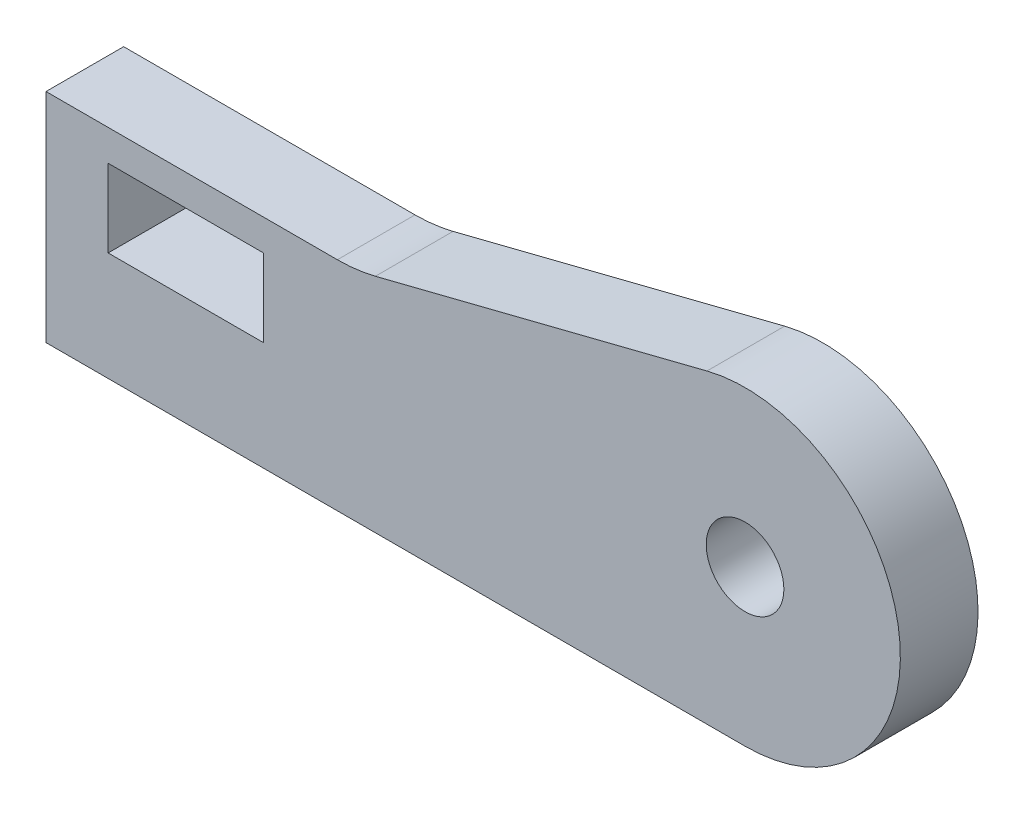
ISO-10303-21;
HEADER;
FILE_DESCRIPTION(('STEP AP214'),'2;1');
FILE_NAME('part.step','',(''),(''),'','','');
FILE_SCHEMA(('AUTOMOTIVE_DESIGN { 1 0 10303 214 1 1 1 1 }'));
ENDSEC;
DATA;
#1=APPLICATION_CONTEXT('core data for automotive mechanical design processes');
#2=APPLICATION_PROTOCOL_DEFINITION('international standard','automotive_design',2000,#1);
#3=PRODUCT_CONTEXT('',#1,'mechanical');
#4=PRODUCT('Part','Part','',(#3));
#5=PRODUCT_RELATED_PRODUCT_CATEGORY('part','',(#4));
#6=PRODUCT_DEFINITION_FORMATION('','',#4);
#7=PRODUCT_DEFINITION_CONTEXT('part definition',#1,'design');
#8=PRODUCT_DEFINITION('design','',#6,#7);
#9=PRODUCT_DEFINITION_SHAPE('','',#8);
#10=(LENGTH_UNIT() NAMED_UNIT(*) SI_UNIT(.MILLI.,.METRE.));
#11=(NAMED_UNIT(*) PLANE_ANGLE_UNIT() SI_UNIT($,.RADIAN.));
#12=(NAMED_UNIT(*) SI_UNIT($,.STERADIAN.) SOLID_ANGLE_UNIT());
#13=UNCERTAINTY_MEASURE_WITH_UNIT(LENGTH_MEASURE(1.E-05),#10,'distance_accuracy_value','');
#14=(GEOMETRIC_REPRESENTATION_CONTEXT(3) GLOBAL_UNCERTAINTY_ASSIGNED_CONTEXT((#13)) GLOBAL_UNIT_ASSIGNED_CONTEXT((#10,
#11,#12)) REPRESENTATION_CONTEXT('',''));
#15=CARTESIAN_POINT('',(0.,0.,0.));
#16=DIRECTION('',(0.,0.,1.));
#17=DIRECTION('',(1.,0.,0.));
#18=AXIS2_PLACEMENT_3D('',#15,#16,#17);
#19=CARTESIAN_POINT('',(-5.55671376494519,24.,5.));
#20=DIRECTION('',(0.,0.,1.));
#21=DIRECTION('',(1.,0.,0.));
#22=AXIS2_PLACEMENT_3D('',#19,#20,#21);
#23=PLANE('',#22);
#24=DIRECTION('',(1.,0.,0.));
#25=VECTOR('',#24,1.);
#26=CARTESIAN_POINT('',(-20.3134328358209,7.,5.));
#27=LINE('',#26,#25);
#28=CARTESIAN_POINT('',(-20.3134328358209,7.,5.));
#29=VERTEX_POINT('',#28);
#30=CARTESIAN_POINT('',(-10.3134328358209,7.,5.));
#31=VERTEX_POINT('',#30);
#32=EDGE_CURVE('E119',#29,#31,#27,.T.);
#33=ORIENTED_EDGE('',*,*,#32,.F.);
#34=DIRECTION('',(0.,-1.,0.));
#35=VECTOR('',#34,1.);
#36=CARTESIAN_POINT('',(-20.3134328358209,12.,5.));
#37=LINE('',#36,#35);
#38=CARTESIAN_POINT('',(-20.3134328358209,12.,5.));
#39=VERTEX_POINT('',#38);
#40=EDGE_CURVE('E111',#39,#29,#37,.T.);
#41=ORIENTED_EDGE('',*,*,#40,.F.);
#42=DIRECTION('',(-1.,0.,0.));
#43=VECTOR('',#42,1.);
#44=CARTESIAN_POINT('',(-20.3134328358209,12.,5.));
#45=LINE('',#44,#43);
#46=CARTESIAN_POINT('',(-10.3134328358209,12.,5.));
#47=VERTEX_POINT('',#46);
#48=EDGE_CURVE('E134',#47,#39,#45,.T.);
#49=ORIENTED_EDGE('',*,*,#48,.F.);
#50=DIRECTION('',(0.,1.,0.));
#51=VECTOR('',#50,1.);
#52=CARTESIAN_POINT('',(-10.3134328358209,12.,5.));
#53=LINE('',#52,#51);
#54=EDGE_CURVE('E132',#31,#47,#53,.T.);
#55=ORIENTED_EDGE('',*,*,#54,.F.);
#56=EDGE_LOOP('',(#33,#41,#49,#55));
#57=FACE_BOUND('',#56,.T.);
#58=DIRECTION('',(0.,-1.,0.));
#59=VECTOR('',#58,1.);
#60=CARTESIAN_POINT('',(-24.3134328358209,0.,5.));
#61=LINE('',#60,#59);
#62=CARTESIAN_POINT('',(-24.3134328358209,14.,5.));
#63=VERTEX_POINT('',#62);
#64=CARTESIAN_POINT('',(-24.3134328358209,0.,5.));
#65=VERTEX_POINT('',#64);
#66=EDGE_CURVE('E150',#63,#65,#61,.T.);
#67=ORIENTED_EDGE('',*,*,#66,.T.);
#68=DIRECTION('',(1.,0.,0.));
#69=VECTOR('',#68,1.);
#70=CARTESIAN_POINT('',(-24.3134328358209,0.,5.));
#71=LINE('',#70,#69);
#72=CARTESIAN_POINT('',(20.6865671641791,0.,5.));
#73=VERTEX_POINT('',#72);
#74=EDGE_CURVE('E153',#65,#73,#71,.T.);
#75=ORIENTED_EDGE('',*,*,#74,.T.);
#76=CARTESIAN_POINT('',(20.6865671641791,10.,5.));
#77=DIRECTION('',(0.,0.,1.));
#78=DIRECTION('',(1.,0.,0.));
#79=AXIS2_PLACEMENT_3D('',#76,#77,#78);
#80=CIRCLE('',#79,10.);
#81=CARTESIAN_POINT('',(18.237856193772,19.6955564349555,5.));
#82=VERTEX_POINT('',#81);
#83=EDGE_CURVE('E156',#73,#82,#80,.T.);
#84=ORIENTED_EDGE('',*,*,#83,.T.);
#85=DIRECTION('',(-0.969555643495554,-0.244871097040711,0.));
#86=VECTOR('',#85,1.);
#87=CARTESIAN_POINT('',(-3.10800279453807,14.3044435650445,5.));
#88=LINE('',#87,#86);
#89=CARTESIAN_POINT('',(-3.10800279453807,14.3044435650445,5.));
#90=VERTEX_POINT('',#89);
#91=EDGE_CURVE('E158',#82,#90,#88,.T.);
#92=ORIENTED_EDGE('',*,*,#91,.T.);
#93=CARTESIAN_POINT('',(-5.55671376494519,24.,5.));
#94=DIRECTION('',(0.,0.,-1.));
#95=DIRECTION('',(1.,0.,0.));
#96=AXIS2_PLACEMENT_3D('',#93,#94,#95);
#97=CIRCLE('',#96,10.);
#98=CARTESIAN_POINT('',(-5.55671376494519,14.,5.));
#99=VERTEX_POINT('',#98);
#100=EDGE_CURVE('E160',#90,#99,#97,.T.);
#101=ORIENTED_EDGE('',*,*,#100,.T.);
#102=DIRECTION('',(-1.,0.,0.));
#103=VECTOR('',#102,1.);
#104=CARTESIAN_POINT('',(-24.3134328358209,14.,5.));
#105=LINE('',#104,#103);
#106=EDGE_CURVE('E162',#99,#63,#105,.T.);
#107=ORIENTED_EDGE('',*,*,#106,.T.);
#108=EDGE_LOOP('',(#67,#75,#84,#92,#101,#107));
#109=FACE_BOUND('',#108,.T.);
#110=CARTESIAN_POINT('',(20.6865671641791,10.,5.));
#111=DIRECTION('',(0.,0.,1.));
#112=DIRECTION('',(1.,0.,0.));
#113=AXIS2_PLACEMENT_3D('',#110,#111,#112);
#114=CIRCLE('',#113,2.5);
#115=CARTESIAN_POINT('',(23.1865671641791,10.,5.));
#116=VERTEX_POINT('',#115);
#117=EDGE_CURVE('E140',#116,#116,#114,.T.);
#118=ORIENTED_EDGE('',*,*,#117,.F.);
#119=EDGE_LOOP('',(#118));
#120=FACE_BOUND('',#119,.T.);
#121=ADVANCED_FACE('F34',(#57,#109,#120),#23,.T.);
#122=CARTESIAN_POINT('',(-5.55671376494519,24.,0.));
#123=DIRECTION('',(0.,0.,1.));
#124=DIRECTION('',(1.,0.,0.));
#125=AXIS2_PLACEMENT_3D('',#122,#123,#124);
#126=PLANE('',#125);
#127=DIRECTION('',(0.,-1.,0.));
#128=VECTOR('',#127,1.);
#129=CARTESIAN_POINT('',(-24.3134328358209,0.,0.));
#130=LINE('',#129,#128);
#131=CARTESIAN_POINT('',(-24.3134328358209,14.,0.));
#132=VERTEX_POINT('',#131);
#133=CARTESIAN_POINT('',(-24.3134328358209,0.,0.));
#134=VERTEX_POINT('',#133);
#135=EDGE_CURVE('E127',#132,#134,#130,.T.);
#136=ORIENTED_EDGE('',*,*,#135,.F.);
#137=DIRECTION('',(-1.,0.,0.));
#138=VECTOR('',#137,1.);
#139=CARTESIAN_POINT('',(-24.3134328358209,14.,0.));
#140=LINE('',#139,#138);
#141=CARTESIAN_POINT('',(-5.55671376494519,14.,0.));
#142=VERTEX_POINT('',#141);
#143=EDGE_CURVE('E154',#142,#132,#140,.T.);
#144=ORIENTED_EDGE('',*,*,#143,.F.);
#145=CARTESIAN_POINT('',(-5.55671376494519,24.,0.));
#146=DIRECTION('',(0.,0.,-1.));
#147=DIRECTION('',(1.,0.,0.));
#148=AXIS2_PLACEMENT_3D('',#145,#146,#147);
#149=CIRCLE('',#148,10.);
#150=CARTESIAN_POINT('',(-3.10800279453807,14.3044435650445,0.));
#151=VERTEX_POINT('',#150);
#152=EDGE_CURVE('E173',#151,#142,#149,.T.);
#153=ORIENTED_EDGE('',*,*,#152,.F.);
#154=DIRECTION('',(-0.969555643495554,-0.244871097040711,0.));
#155=VECTOR('',#154,1.);
#156=CARTESIAN_POINT('',(-3.10800279453807,14.3044435650445,0.));
#157=LINE('',#156,#155);
#158=CARTESIAN_POINT('',(18.237856193772,19.6955564349555,0.));
#159=VERTEX_POINT('',#158);
#160=EDGE_CURVE('E171',#159,#151,#157,.T.);
#161=ORIENTED_EDGE('',*,*,#160,.F.);
#162=CARTESIAN_POINT('',(20.6865671641791,10.,0.));
#163=DIRECTION('',(0.,0.,1.));
#164=DIRECTION('',(1.,0.,0.));
#165=AXIS2_PLACEMENT_3D('',#162,#163,#164);
#166=CIRCLE('',#165,10.);
#167=CARTESIAN_POINT('',(20.6865671641791,0.,0.));
#168=VERTEX_POINT('',#167);
#169=EDGE_CURVE('E169',#168,#159,#166,.T.);
#170=ORIENTED_EDGE('',*,*,#169,.F.);
#171=DIRECTION('',(1.,0.,0.));
#172=VECTOR('',#171,1.);
#173=CARTESIAN_POINT('',(-24.3134328358209,0.,0.));
#174=LINE('',#173,#172);
#175=EDGE_CURVE('E167',#134,#168,#174,.T.);
#176=ORIENTED_EDGE('',*,*,#175,.F.);
#177=EDGE_LOOP('',(#136,#144,#153,#161,#170,#176));
#178=FACE_BOUND('',#177,.T.);
#179=DIRECTION('',(0.,-1.,0.));
#180=VECTOR('',#179,1.);
#181=CARTESIAN_POINT('',(-20.3134328358209,12.,0.));
#182=LINE('',#181,#180);
#183=CARTESIAN_POINT('',(-20.3134328358209,12.,0.));
#184=VERTEX_POINT('',#183);
#185=CARTESIAN_POINT('',(-20.3134328358209,7.,0.));
#186=VERTEX_POINT('',#185);
#187=EDGE_CURVE('E57',#184,#186,#182,.T.);
#188=ORIENTED_EDGE('',*,*,#187,.T.);
#189=DIRECTION('',(1.,0.,0.));
#190=VECTOR('',#189,1.);
#191=CARTESIAN_POINT('',(-20.3134328358209,7.,0.));
#192=LINE('',#191,#190);
#193=CARTESIAN_POINT('',(-10.3134328358209,7.,0.));
#194=VERTEX_POINT('',#193);
#195=EDGE_CURVE('E126',#186,#194,#192,.T.);
#196=ORIENTED_EDGE('',*,*,#195,.T.);
#197=DIRECTION('',(0.,1.,0.));
#198=VECTOR('',#197,1.);
#199=CARTESIAN_POINT('',(-10.3134328358209,12.,0.));
#200=LINE('',#199,#198);
#201=CARTESIAN_POINT('',(-10.3134328358209,12.,0.));
#202=VERTEX_POINT('',#201);
#203=EDGE_CURVE('E142',#194,#202,#200,.T.);
#204=ORIENTED_EDGE('',*,*,#203,.T.);
#205=DIRECTION('',(-1.,0.,0.));
#206=VECTOR('',#205,1.);
#207=CARTESIAN_POINT('',(-20.3134328358209,12.,0.));
#208=LINE('',#207,#206);
#209=EDGE_CURVE('E120',#202,#184,#208,.T.);
#210=ORIENTED_EDGE('',*,*,#209,.T.);
#211=EDGE_LOOP('',(#188,#196,#204,#210));
#212=FACE_BOUND('',#211,.T.);
#213=CARTESIAN_POINT('',(20.6865671641791,10.,0.));
#214=DIRECTION('',(0.,0.,1.));
#215=DIRECTION('',(1.,0.,0.));
#216=AXIS2_PLACEMENT_3D('',#213,#214,#215);
#217=CIRCLE('',#216,2.5);
#218=CARTESIAN_POINT('',(23.1865671641791,10.,0.));
#219=VERTEX_POINT('',#218);
#220=EDGE_CURVE('E252',#219,#219,#217,.T.);
#221=ORIENTED_EDGE('',*,*,#220,.T.);
#222=EDGE_LOOP('',(#221));
#223=FACE_BOUND('',#222,.T.);
#224=ADVANCED_FACE('F197',(#178,#212,#223),#126,.F.);
#225=CARTESIAN_POINT('',(-24.3134328358209,0.,5.));
#226=DIRECTION('',(1.,0.,0.));
#227=DIRECTION('',(0.,1.,0.));
#228=AXIS2_PLACEMENT_3D('',#225,#226,#227);
#229=PLANE('',#228);
#230=ORIENTED_EDGE('',*,*,#135,.T.);
#231=DIRECTION('',(0.,0.,-1.));
#232=VECTOR('',#231,1.);
#233=CARTESIAN_POINT('',(-24.3134328358209,0.,5.));
#234=LINE('',#233,#232);
#235=EDGE_CURVE('E11',#65,#134,#234,.T.);
#236=ORIENTED_EDGE('',*,*,#235,.F.);
#237=ORIENTED_EDGE('',*,*,#66,.F.);
#238=DIRECTION('',(0.,0.,-1.));
#239=VECTOR('',#238,1.);
#240=CARTESIAN_POINT('',(-24.3134328358209,14.,5.));
#241=LINE('',#240,#239);
#242=EDGE_CURVE('E164',#63,#132,#241,.T.);
#243=ORIENTED_EDGE('',*,*,#242,.T.);
#244=EDGE_LOOP('',(#230,#236,#237,#243));
#245=FACE_BOUND('',#244,.T.);
#246=ADVANCED_FACE('F36',(#245),#229,.F.);
#247=CARTESIAN_POINT('',(-24.3134328358209,0.,5.));
#248=DIRECTION('',(0.,1.,0.));
#249=DIRECTION('',(0.,0.,1.));
#250=AXIS2_PLACEMENT_3D('',#247,#248,#249);
#251=PLANE('',#250);
#252=ORIENTED_EDGE('',*,*,#175,.T.);
#253=DIRECTION('',(0.,0.,-1.));
#254=VECTOR('',#253,1.);
#255=CARTESIAN_POINT('',(20.6865671641791,0.,5.));
#256=LINE('',#255,#254);
#257=EDGE_CURVE('E42',#73,#168,#256,.T.);
#258=ORIENTED_EDGE('',*,*,#257,.F.);
#259=ORIENTED_EDGE('',*,*,#74,.F.);
#260=ORIENTED_EDGE('',*,*,#235,.T.);
#261=EDGE_LOOP('',(#252,#258,#259,#260));
#262=FACE_BOUND('',#261,.T.);
#263=ADVANCED_FACE('F214',(#262),#251,.F.);
#264=CARTESIAN_POINT('',(20.6865671641791,10.,5.));
#265=DIRECTION('',(0.,0.,-1.));
#266=DIRECTION('',(-1.,0.,0.));
#267=AXIS2_PLACEMENT_3D('',#264,#265,#266);
#268=CYLINDRICAL_SURFACE('',#267,10.);
#269=ORIENTED_EDGE('',*,*,#169,.T.);
#270=DIRECTION('',(0.,0.,-1.));
#271=VECTOR('',#270,1.);
#272=CARTESIAN_POINT('',(18.237856193772,19.6955564349555,5.));
#273=LINE('',#272,#271);
#274=EDGE_CURVE('E184',#82,#159,#273,.T.);
#275=ORIENTED_EDGE('',*,*,#274,.F.);
#276=ORIENTED_EDGE('',*,*,#83,.F.);
#277=ORIENTED_EDGE('',*,*,#257,.T.);
#278=EDGE_LOOP('',(#269,#275,#276,#277));
#279=FACE_BOUND('',#278,.T.);
#280=ADVANCED_FACE('F191',(#279),#268,.T.);
#281=CARTESIAN_POINT('',(-3.10800279453807,14.3044435650445,5.));
#282=DIRECTION('',(0.244871097040711,-0.969555643495554,0.));
#283=DIRECTION('',(0.969555643495554,0.244871097040711,0.));
#284=AXIS2_PLACEMENT_3D('',#281,#282,#283);
#285=PLANE('',#284);
#286=ORIENTED_EDGE('',*,*,#160,.T.);
#287=DIRECTION('',(0.,0.,-1.));
#288=VECTOR('',#287,1.);
#289=CARTESIAN_POINT('',(-3.10800279453807,14.3044435650445,5.));
#290=LINE('',#289,#288);
#291=EDGE_CURVE('E181',#90,#151,#290,.T.);
#292=ORIENTED_EDGE('',*,*,#291,.F.);
#293=ORIENTED_EDGE('',*,*,#91,.F.);
#294=ORIENTED_EDGE('',*,*,#274,.T.);
#295=EDGE_LOOP('',(#286,#292,#293,#294));
#296=FACE_BOUND('',#295,.T.);
#297=ADVANCED_FACE('F203',(#296),#285,.F.);
#298=CARTESIAN_POINT('',(-5.55671376494519,24.,5.));
#299=DIRECTION('',(0.,0.,-1.));
#300=DIRECTION('',(-1.,0.,0.));
#301=AXIS2_PLACEMENT_3D('',#298,#299,#300);
#302=CYLINDRICAL_SURFACE('',#301,10.);
#303=ORIENTED_EDGE('',*,*,#152,.T.);
#304=DIRECTION('',(0.,0.,-1.));
#305=VECTOR('',#304,1.);
#306=CARTESIAN_POINT('',(-5.55671376494519,14.,5.));
#307=LINE('',#306,#305);
#308=EDGE_CURVE('E178',#99,#142,#307,.T.);
#309=ORIENTED_EDGE('',*,*,#308,.F.);
#310=ORIENTED_EDGE('',*,*,#100,.F.);
#311=ORIENTED_EDGE('',*,*,#291,.T.);
#312=EDGE_LOOP('',(#303,#309,#310,#311));
#313=FACE_BOUND('',#312,.T.);
#314=ADVANCED_FACE('F207',(#313),#302,.F.);
#315=CARTESIAN_POINT('',(-24.3134328358209,14.,5.));
#316=DIRECTION('',(0.,-1.,0.));
#317=DIRECTION('',(1.,0.,0.));
#318=AXIS2_PLACEMENT_3D('',#315,#316,#317);
#319=PLANE('',#318);
#320=ORIENTED_EDGE('',*,*,#143,.T.);
#321=ORIENTED_EDGE('',*,*,#242,.F.);
#322=ORIENTED_EDGE('',*,*,#106,.F.);
#323=ORIENTED_EDGE('',*,*,#308,.T.);
#324=EDGE_LOOP('',(#320,#321,#322,#323));
#325=FACE_BOUND('',#324,.T.);
#326=ADVANCED_FACE('F217',(#325),#319,.F.);
#327=CARTESIAN_POINT('',(-20.3134328358209,12.,5.));
#328=DIRECTION('',(1.,0.,0.));
#329=DIRECTION('',(0.,0.,-1.));
#330=AXIS2_PLACEMENT_3D('',#327,#328,#329);
#331=PLANE('',#330);
#332=ORIENTED_EDGE('',*,*,#187,.F.);
#333=DIRECTION('',(0.,0.,-1.));
#334=VECTOR('',#333,1.);
#335=CARTESIAN_POINT('',(-20.3134328358209,12.,5.));
#336=LINE('',#335,#334);
#337=EDGE_CURVE('E115',#39,#184,#336,.T.);
#338=ORIENTED_EDGE('',*,*,#337,.F.);
#339=ORIENTED_EDGE('',*,*,#40,.T.);
#340=DIRECTION('',(0.,0.,-1.));
#341=VECTOR('',#340,1.);
#342=CARTESIAN_POINT('',(-20.3134328358209,7.,5.));
#343=LINE('',#342,#341);
#344=EDGE_CURVE('E114',#29,#186,#343,.T.);
#345=ORIENTED_EDGE('',*,*,#344,.T.);
#346=EDGE_LOOP('',(#332,#338,#339,#345));
#347=FACE_BOUND('',#346,.T.);
#348=ADVANCED_FACE('F113',(#347),#331,.T.);
#349=CARTESIAN_POINT('',(-20.3134328358209,7.,5.));
#350=DIRECTION('',(0.,1.,0.));
#351=DIRECTION('',(0.,0.,1.));
#352=AXIS2_PLACEMENT_3D('',#349,#350,#351);
#353=PLANE('',#352);
#354=ORIENTED_EDGE('',*,*,#195,.F.);
#355=ORIENTED_EDGE('',*,*,#344,.F.);
#356=ORIENTED_EDGE('',*,*,#32,.T.);
#357=DIRECTION('',(0.,0.,-1.));
#358=VECTOR('',#357,1.);
#359=CARTESIAN_POINT('',(-10.3134328358209,7.,5.));
#360=LINE('',#359,#358);
#361=EDGE_CURVE('E128',#31,#194,#360,.T.);
#362=ORIENTED_EDGE('',*,*,#361,.T.);
#363=EDGE_LOOP('',(#354,#355,#356,#362));
#364=FACE_BOUND('',#363,.T.);
#365=ADVANCED_FACE('F123',(#364),#353,.T.);
#366=CARTESIAN_POINT('',(-10.3134328358209,12.,5.));
#367=DIRECTION('',(-1.,0.,0.));
#368=DIRECTION('',(0.,0.,1.));
#369=AXIS2_PLACEMENT_3D('',#366,#367,#368);
#370=PLANE('',#369);
#371=ORIENTED_EDGE('',*,*,#203,.F.);
#372=ORIENTED_EDGE('',*,*,#361,.F.);
#373=ORIENTED_EDGE('',*,*,#54,.T.);
#374=DIRECTION('',(0.,0.,-1.));
#375=VECTOR('',#374,1.);
#376=CARTESIAN_POINT('',(-10.3134328358209,12.,5.));
#377=LINE('',#376,#375);
#378=EDGE_CURVE('E49',#47,#202,#377,.T.);
#379=ORIENTED_EDGE('',*,*,#378,.T.);
#380=EDGE_LOOP('',(#371,#372,#373,#379));
#381=FACE_BOUND('',#380,.T.);
#382=ADVANCED_FACE('F235',(#381),#370,.T.);
#383=CARTESIAN_POINT('',(-20.3134328358209,12.,5.));
#384=DIRECTION('',(0.,-1.,0.));
#385=DIRECTION('',(0.,0.,-1.));
#386=AXIS2_PLACEMENT_3D('',#383,#384,#385);
#387=PLANE('',#386);
#388=ORIENTED_EDGE('',*,*,#209,.F.);
#389=ORIENTED_EDGE('',*,*,#378,.F.);
#390=ORIENTED_EDGE('',*,*,#48,.T.);
#391=ORIENTED_EDGE('',*,*,#337,.T.);
#392=EDGE_LOOP('',(#388,#389,#390,#391));
#393=FACE_BOUND('',#392,.T.);
#394=ADVANCED_FACE('F238',(#393),#387,.T.);
#395=CARTESIAN_POINT('',(20.6865671641791,10.,5.));
#396=DIRECTION('',(0.,0.,-1.));
#397=DIRECTION('',(-1.,0.,0.));
#398=AXIS2_PLACEMENT_3D('',#395,#396,#397);
#399=CYLINDRICAL_SURFACE('',#398,2.5);
#400=ORIENTED_EDGE('',*,*,#117,.T.);
#401=EDGE_LOOP('',(#400));
#402=FACE_BOUND('',#401,.T.);
#403=ORIENTED_EDGE('',*,*,#220,.F.);
#404=EDGE_LOOP('',(#403));
#405=FACE_BOUND('',#404,.T.);
#406=ADVANCED_FACE('F242',(#402,#405),#399,.F.);
#407=CLOSED_SHELL('',(#121,#224,#246,#263,#280,#297,#314,#326,#348,#365,#382,#394,#406));
#408=MANIFOLD_SOLID_BREP('B2',#407);
#409=ADVANCED_BREP_SHAPE_REPRESENTATION('',(#18,#408),#14);
#410=SHAPE_DEFINITION_REPRESENTATION(#9,#409);
ENDSEC;
END-ISO-10303-21;
